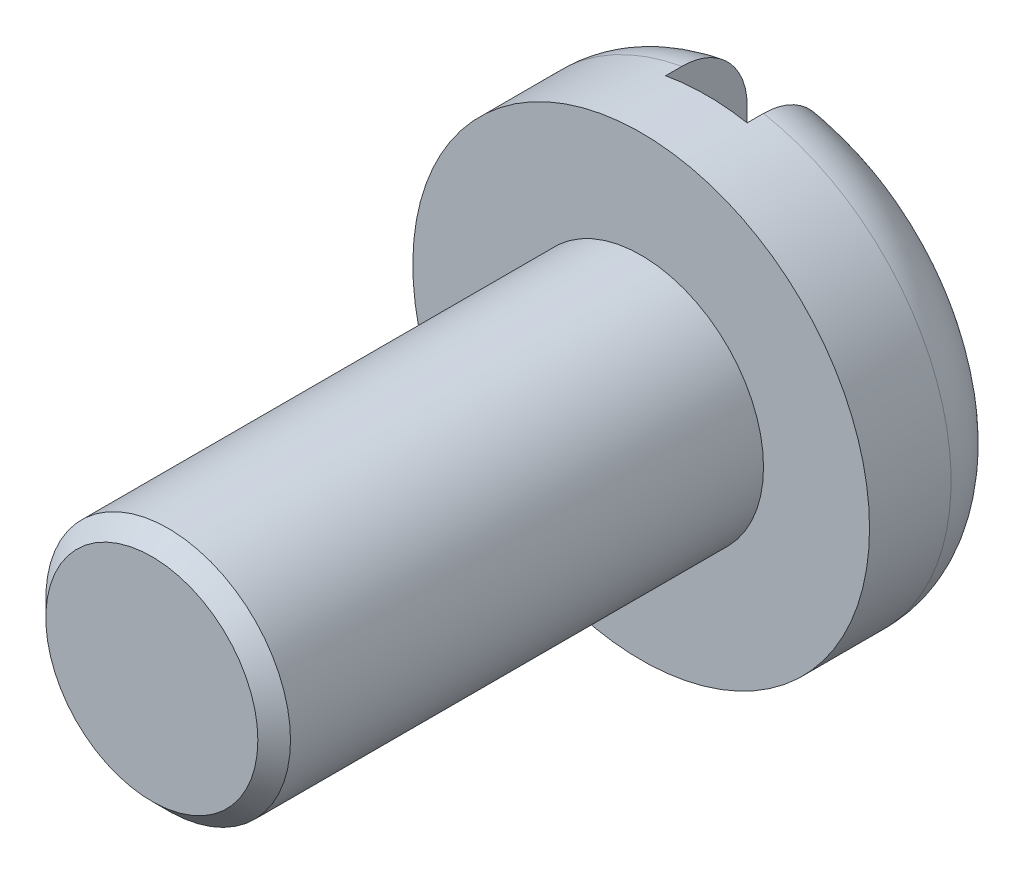
ISO-10303-21;
HEADER;
FILE_DESCRIPTION(('STEP AP214'),'2;1');
FILE_NAME('part.step','',(''),(''),'','','');
FILE_SCHEMA(('AUTOMOTIVE_DESIGN { 1 0 10303 214 1 1 1 1 }'));
ENDSEC;
DATA;
#1=APPLICATION_CONTEXT('core data for automotive mechanical design processes');
#2=APPLICATION_PROTOCOL_DEFINITION('international standard','automotive_design',2000,#1);
#3=PRODUCT_CONTEXT('',#1,'mechanical');
#4=PRODUCT('Part','Part','',(#3));
#5=PRODUCT_RELATED_PRODUCT_CATEGORY('part','',(#4));
#6=PRODUCT_DEFINITION_FORMATION('','',#4);
#7=PRODUCT_DEFINITION_CONTEXT('part definition',#1,'design');
#8=PRODUCT_DEFINITION('design','',#6,#7);
#9=PRODUCT_DEFINITION_SHAPE('','',#8);
#10=(LENGTH_UNIT() NAMED_UNIT(*) SI_UNIT(.MILLI.,.METRE.));
#11=(NAMED_UNIT(*) PLANE_ANGLE_UNIT() SI_UNIT($,.RADIAN.));
#12=(NAMED_UNIT(*) SI_UNIT($,.STERADIAN.) SOLID_ANGLE_UNIT());
#13=UNCERTAINTY_MEASURE_WITH_UNIT(LENGTH_MEASURE(1.E-05),#10,'distance_accuracy_value','');
#14=(GEOMETRIC_REPRESENTATION_CONTEXT(3) GLOBAL_UNCERTAINTY_ASSIGNED_CONTEXT((#13)) GLOBAL_UNIT_ASSIGNED_CONTEXT((#10,
#11,#12)) REPRESENTATION_CONTEXT('',''));
#15=CARTESIAN_POINT('',(0.,0.,0.));
#16=DIRECTION('',(0.,0.,1.));
#17=DIRECTION('',(1.,0.,0.));
#18=AXIS2_PLACEMENT_3D('',#15,#16,#17);
#19=CARTESIAN_POINT('',(0.,0.,0.));
#20=DIRECTION('',(0.,0.,1.));
#21=DIRECTION('',(1.,0.,0.));
#22=AXIS2_PLACEMENT_3D('',#19,#20,#21);
#23=PLANE('',#22);
#24=CARTESIAN_POINT('',(0.,0.,0.));
#25=DIRECTION('',(0.,0.,1.));
#26=DIRECTION('',(1.,0.,0.));
#27=AXIS2_PLACEMENT_3D('',#24,#25,#26);
#28=CIRCLE('',#27,2.);
#29=CARTESIAN_POINT('',(-0.5,-1.93649167310372,0.));
#30=VERTEX_POINT('',#29);
#31=CARTESIAN_POINT('',(-0.5,1.93649167310367,0.));
#32=VERTEX_POINT('',#31);
#33=EDGE_CURVE('E106',#30,#32,#28,.F.);
#34=ORIENTED_EDGE('',*,*,#33,.T.);
#35=DIRECTION('',(0.,1.,0.));
#36=VECTOR('',#35,1.);
#37=CARTESIAN_POINT('',(-0.499999999999987,-2.79999999999997,0.));
#38=LINE('',#37,#36);
#39=EDGE_CURVE('E94',#30,#32,#38,.T.);
#40=ORIENTED_EDGE('',*,*,#39,.F.);
#41=EDGE_LOOP('',(#34,#40));
#42=FACE_BOUND('',#41,.T.);
#43=ADVANCED_FACE('F32',(#42),#23,.F.);
#44=CARTESIAN_POINT('',(0.,0.,0.8));
#45=DIRECTION('',(0.,0.,1.));
#46=DIRECTION('',(1.,0.,0.));
#47=AXIS2_PLACEMENT_3D('',#44,#45,#46);
#48=TOROIDAL_SURFACE('',#47,2.,0.8);
#49=CARTESIAN_POINT('',(-0.500000000000042,-2.574922324518,0.298155199525206));
#50=CARTESIAN_POINT('',(-0.500000000000064,-2.54598098806483,0.262888244626921));
#51=CARTESIAN_POINT('',(-0.500000000000017,-2.51399085375587,0.230073383773666));
#52=CARTESIAN_POINT('',(-0.499999999999956,-2.44489770330804,0.170290375937446));
#53=CARTESIAN_POINT('',(-0.499999999999943,-2.40778734484533,0.14333077083532));
#54=CARTESIAN_POINT('',(-0.499999999999947,-2.3296378729819,0.0960285229568036));
#55=CARTESIAN_POINT('',(-0.499999999999966,-2.28860446041037,0.0756764619958677));
#56=CARTESIAN_POINT('',(-0.500000000000008,-2.20376135068432,0.0420244924251314));
#57=CARTESIAN_POINT('',(-0.500000000000031,-2.15995236699676,0.0287227796749258));
#58=CARTESIAN_POINT('',(-0.500000000000025,-2.06997091394333,0.00925183248130342));
#59=CARTESIAN_POINT('',(-0.499999999999993,-2.02377040690542,0.00321234810147741));
#60=CARTESIAN_POINT('',(-0.49999999999998,-1.93100263497437,-0.00124877563349874));
#61=CARTESIAN_POINT('',(-0.499999999999998,-1.88443530458141,0.000330977762108387));
#62=CARTESIAN_POINT('',(-0.500000000000003,-1.79088327346646,0.0111178799923772));
#63=CARTESIAN_POINT('',(-0.49999999999999,-1.7439228144173,0.0205353470541913));
#64=CARTESIAN_POINT('',(-0.499999999999983,-1.65217679369091,0.046935421935074));
#65=CARTESIAN_POINT('',(-0.499999999999988,-1.60739158710236,0.0639192603179388));
#66=CARTESIAN_POINT('',(-0.499999999999985,-1.52019073232421,0.105445949791884));
#67=CARTESIAN_POINT('',(-0.499999999999978,-1.47785400136175,0.130154782287374));
#68=CARTESIAN_POINT('',(-0.499999999999995,-1.39792453015221,0.18634538845088));
#69=CARTESIAN_POINT('',(-0.50000000000002,-1.36033263198163,0.217828361667366));
#70=CARTESIAN_POINT('',(-0.500000000000009,-1.29120447950117,0.286694192458513));
#71=CARTESIAN_POINT('',(-0.499999999999974,-1.25965123178523,0.324059937841605));
#72=CARTESIAN_POINT('',(-0.499999999999999,-1.20369168856285,0.403817480274002));
#73=CARTESIAN_POINT('',(-0.500000000000059,-1.17928268604714,0.44620736506247));
#74=CARTESIAN_POINT('',(-0.500000000000053,-1.13992248130589,0.532354713105318));
#75=CARTESIAN_POINT('',(-0.499999999999993,-1.12452210271751,0.575906194985524));
#76=CARTESIAN_POINT('',(-0.49999999999998,-1.10201829416784,0.66509381867765));
#77=CARTESIAN_POINT('',(-0.500000000000027,-1.09490840158941,0.710728307862662));
#78=CARTESIAN_POINT('',(-0.500000000000029,-1.08965339575104,0.798660775802905));
#79=CARTESIAN_POINT('',(-0.499999999999991,-1.09080730068015,0.840918076012923));
#80=CARTESIAN_POINT('',(-0.499999999999982,-1.10037450172082,0.924598224718412));
#81=CARTESIAN_POINT('',(-0.500000000000013,-1.10878745994187,0.966021111961848));
#82=CARTESIAN_POINT('',(-0.500000000000016,-1.13216837267961,1.04597158865165));
#83=CARTESIAN_POINT('',(-0.499999999999991,-1.14698904456269,1.08454267031556));
#84=CARTESIAN_POINT('',(-0.499999999999982,-1.18251177579709,1.15886756045566));
#85=CARTESIAN_POINT('',(-0.5,-1.20321527714693,1.19462067544403));
#86=CARTESIAN_POINT('',(-0.500000000000001,-1.25126751354911,1.26474992143909));
#87=CARTESIAN_POINT('',(-0.499999999999984,-1.27895554890733,1.29889325268955));
#88=CARTESIAN_POINT('',(-0.499999999999989,-1.3392878702617,1.36247528595323));
#89=CARTESIAN_POINT('',(-0.500000000000013,-1.37193384773364,1.39191237529941));
#90=CARTESIAN_POINT('',(-0.500000000000016,-1.44401810740901,1.44758530807222));
#91=CARTESIAN_POINT('',(-0.49999999999999,-1.48378730323865,1.47339358366004));
#92=CARTESIAN_POINT('',(-0.499999999999983,-1.56697728558621,1.51824355540426));
#93=CARTESIAN_POINT('',(-0.5,-1.61039886330884,1.53728378072535));
#94=CARTESIAN_POINT('',(-0.500000000000001,-1.70136104276629,1.56863849264839));
#95=CARTESIAN_POINT('',(-0.499999999999984,-1.74899346897788,1.58068768090996));
#96=CARTESIAN_POINT('',(-0.499999999999989,-1.84561382312309,1.59655662210236));
#97=CARTESIAN_POINT('',(-0.500000000000011,-1.89460174641329,1.60037640322053));
#98=CARTESIAN_POINT('',(-0.500000000000017,-1.9921524314953,1.59956806537918));
#99=CARTESIAN_POINT('',(-0.500000000000002,-2.04071566638595,1.59500198496043));
#100=CARTESIAN_POINT('',(-0.499999999999971,-2.13632725414342,1.57755309739998));
#101=CARTESIAN_POINT('',(-0.499999999999956,-2.18337580544831,1.56467138437918));
#102=CARTESIAN_POINT('',(-0.499999999999962,-2.27328529537051,1.53131446404627));
#103=CARTESIAN_POINT('',(-0.499999999999981,-2.3162240941652,1.51104918059278));
#104=CARTESIAN_POINT('',(-0.499999999999992,-2.39795495079203,1.46340202209778));
#105=CARTESIAN_POINT('',(-0.499999999999983,-2.43674763214091,1.43602121925978));
#106=CARTESIAN_POINT('',(-0.499999999999963,-2.50796623414367,1.37573601278644));
#107=CARTESIAN_POINT('',(-0.499999999999952,-2.54053689486565,1.34300254475207));
#108=CARTESIAN_POINT('',(-0.500000000000021,-2.59957752568887,1.2724306558834));
#109=CARTESIAN_POINT('',(-0.500000000000102,-2.62604823039698,1.23459285062639));
#110=CARTESIAN_POINT('',(-0.500000000000093,-2.67157353959601,1.15573976382321));
#111=CARTESIAN_POINT('',(-0.500000000000008,-2.69077061117966,1.11480669165031));
#112=CARTESIAN_POINT('',(-0.499999999999965,-2.72191897598462,1.03027270766606));
#113=CARTESIAN_POINT('',(-0.500000000000008,-2.73387115561365,0.986672122942012));
#114=CARTESIAN_POINT('',(-0.500000000000021,-2.75005556797333,0.898637160107996));
#115=CARTESIAN_POINT('',(-0.499999999999992,-2.75438419022644,0.854220475286738));
#116=CARTESIAN_POINT('',(-0.499999999999981,-2.75548594113135,0.765281171564029));
#117=CARTESIAN_POINT('',(-0.5,-2.75225733036693,0.720758530631277));
#118=CARTESIAN_POINT('',(-0.500000000000001,-2.73837145135229,0.633077517478008));
#119=CARTESIAN_POINT('',(-0.499999999999984,-2.72774415965583,0.589914372145898));
#120=CARTESIAN_POINT('',(-0.499999999999989,-2.69941974932609,0.506017569457456));
#121=CARTESIAN_POINT('',(-0.500000000000011,-2.68173177147183,0.465280848903881));
#122=CARTESIAN_POINT('',(-0.499999999999995,-2.6486018933594,0.403636926764014));
#123=CARTESIAN_POINT('',(-0.499999999999978,-2.63530419806188,0.381550226470756));
#124=CARTESIAN_POINT('',(-0.499999999999995,-2.60663582244822,0.338766791147228));
#125=CARTESIAN_POINT('',(-0.50000000000003,-2.59126516322905,0.318070041974346));
#126=CARTESIAN_POINT('',(-0.500000000000042,-2.574922324518,0.298155199525206));
#127=B_SPLINE_CURVE_WITH_KNOTS('',3,(#49,#50,#51,#52,#53,#54,#55,#56,#57,#58,#59,#60,#61,#62,
#63,#64,#65,#66,#67,#68,#69,#70,#71,#72,#73,#74,#75,#76,#77,#78,#79,#80,#81,#82,#83,#84,#85,#86,
#87,#88,#89,#90,#91,#92,#93,#94,#95,#96,#97,#98,#99,#100,#101,#102,#103,#104,#105,#106,#107,
#108,#109,#110,#111,#112,#113,#114,#115,#116,#117,#118,#119,#120,#121,#122,#123,#124,#125,#126),
.UNSPECIFIED.,.T.,.F.,(4,2,2,2,2,2,2,2,2,2,2,2,2,2,2,2,2,2,2,2,2,2,2,2,2,2,2,2,2,2,2,2,2,2,2,2,
2,2,4),(0.,0.136769193085177,0.273736589920394,0.410507891781044,0.547244177795591,
0.68638878734272,0.825558832649965,0.968588530443755,1.11164149850147,1.25800809201401,
1.40440062513062,1.5503749329885,1.69629385824464,1.83412607973232,1.97185078597633,
2.0980401485379,2.22422363762208,2.34764929877682,2.47110524015382,2.60242555016918,
2.73379076312852,2.87538180880564,3.01700360631827,3.16369746316592,3.3103908175575,
3.45600330421428,3.60159663596026,3.74333790058163,3.88505781926302,4.02291414270548,
4.16075385566943,4.29573382427652,4.43069727483905,4.56394170366886,4.69721680381809,
4.82995504436945,4.96252199615689,5.0397547671254,5.11698675213922),.UNSPECIFIED.);
#128=CARTESIAN_POINT('',(-0.499999999999917,-2.75499546279123,0.8));
#129=VERTEX_POINT('',#128);
#130=EDGE_CURVE('E147',#129,#30,#127,.T.);
#131=ORIENTED_EDGE('',*,*,#130,.F.);
#132=CARTESIAN_POINT('',(0.,0.,0.8));
#133=DIRECTION('',(0.,0.,1.));
#134=DIRECTION('',(1.,0.,0.));
#135=AXIS2_PLACEMENT_3D('',#132,#133,#134);
#136=CIRCLE('',#135,2.8);
#137=CARTESIAN_POINT('',(-0.500000000000028,2.7549954627912,0.8));
#138=VERTEX_POINT('',#137);
#139=EDGE_CURVE('E107',#138,#129,#136,.T.);
#140=ORIENTED_EDGE('',*,*,#139,.F.);
#141=CARTESIAN_POINT('',(-0.499999999356501,1.17166829458473,0.46418686904753));
#142=CARTESIAN_POINT('',(-0.499999999007219,1.19267357615146,0.422417780507498));
#143=CARTESIAN_POINT('',(-0.499999999733716,1.21743797333864,0.382484068214903));
#144=CARTESIAN_POINT('',(-0.500000000266866,1.27341877739793,0.30735400104595));
#145=CARTESIAN_POINT('',(-0.500000000071411,1.30464980628043,0.272168686107269));
#146=CARTESIAN_POINT('',(-0.499999999928815,1.37235748491803,0.207510707786025));
#147=CARTESIAN_POINT('',(-0.499999999980891,1.40881724534706,0.178020342456158));
#148=CARTESIAN_POINT('',(-0.500000000019074,1.48597833534383,0.125299278185819));
#149=CARTESIAN_POINT('',(-0.500000000005209,1.5266777935571,0.10206583361082));
#150=CARTESIAN_POINT('',(-0.499999999994576,1.61302287504707,0.0615752064472882));
#151=CARTESIAN_POINT('',(-0.49999999999854,1.65880348194959,0.0446051102007901));
#152=CARTESIAN_POINT('',(-0.500000000001434,1.75256520926182,0.0185470420039302));
#153=CARTESIAN_POINT('',(-0.500000000000363,1.80054669322732,0.00946037726494076));
#154=CARTESIAN_POINT('',(-0.499999999999581,1.89757398197848,-0.000503602469736283));
#155=CARTESIAN_POINT('',(-0.499999999999874,1.94662352533386,-0.00134482041100667));
#156=CARTESIAN_POINT('',(-0.500000000000099,2.04413927232538,0.00542159003976711));
#157=CARTESIAN_POINT('',(-0.50000000000003,2.09260554052552,0.0130282744560471));
#158=CARTESIAN_POINT('',(-0.499999999999972,2.18638284766427,0.0363136597219342));
#159=CARTESIAN_POINT('',(-0.499999999999981,2.23174072313643,0.0518035405617408));
#160=CARTESIAN_POINT('',(-0.499999999999993,2.31909462384134,0.090397317595015));
#161=CARTESIAN_POINT('',(-0.499999999999995,2.36109117492435,0.113500019923071));
#162=CARTESIAN_POINT('',(-0.500000000000005,2.43926883717495,0.165951907511055));
#163=CARTESIAN_POINT('',(-0.500000000000012,2.47558066725009,0.195106304948042));
#164=CARTESIAN_POINT('',(-0.499999999999961,2.54264688321358,0.259229250250845));
#165=CARTESIAN_POINT('',(-0.499999999999904,2.57340200694014,0.294197025011071));
#166=CARTESIAN_POINT('',(-0.499999999999903,2.62773971054273,0.368070214995808));
#167=CARTESIAN_POINT('',(-0.499999999999957,2.65147213285657,0.406865462624137));
#168=CARTESIAN_POINT('',(-0.500000000000016,2.69196936040413,0.487936656036954));
#169=CARTESIAN_POINT('',(-0.500000000000021,2.70873482403591,0.530212272463766));
#170=CARTESIAN_POINT('',(-0.500000000000007,2.73457417408301,0.616346516557325));
#171=CARTESIAN_POINT('',(-0.499999999999988,2.74376162387099,0.660171105210678));
#172=CARTESIAN_POINT('',(-0.499999999999985,2.75459021275317,0.748742353799453));
#173=CARTESIAN_POINT('',(-0.5,2.7562317357709,0.793488966707539));
#174=CARTESIAN_POINT('',(-0.500000000000001,2.75193406507526,0.882296051446308));
#175=CARTESIAN_POINT('',(-0.499999999999988,2.7460486796649,0.926359139654561));
#176=CARTESIAN_POINT('',(-0.499999999999985,2.72696875366774,1.01287203680982));
#177=CARTESIAN_POINT('',(-0.499999999999996,2.7137742978086,1.05532186445184));
#178=CARTESIAN_POINT('',(-0.500000000000004,2.68046062721738,1.13744918694941));
#179=CARTESIAN_POINT('',(-0.500000000000001,2.66033585198125,1.17712442478083));
#180=CARTESIAN_POINT('',(-0.499999999999972,2.61376491387087,1.25257058669212));
#181=CARTESIAN_POINT('',(-0.499999999999946,2.58731858541521,1.28834140846729));
#182=CARTESIAN_POINT('',(-0.499999999999944,2.5286285872319,1.35530700199108));
#183=CARTESIAN_POINT('',(-0.49999999999997,2.49633699794396,1.38645975622345));
#184=CARTESIAN_POINT('',(-0.500000000000003,2.42705565551312,1.44300481630574));
#185=CARTESIAN_POINT('',(-0.500000000000012,2.39006560545065,1.4683967578179));
#186=CARTESIAN_POINT('',(-0.499999999999989,2.31180075625716,1.51316085536133));
#187=CARTESIAN_POINT('',(-0.499999999999956,2.27046570719732,1.53242761609144));
#188=CARTESIAN_POINT('',(-0.500000000000017,2.18519964476282,1.5639258999662));
#189=CARTESIAN_POINT('',(-0.50000000000011,2.14126836546617,1.57615670106222));
#190=CARTESIAN_POINT('',(-0.500000000000113,2.0509556255416,1.59355624479341));
#191=CARTESIAN_POINT('',(-0.500000000000017,2.00454082128188,1.59855176700942));
#192=CARTESIAN_POINT('',(-0.499999999999956,1.91151980618021,1.60090411836747));
#193=CARTESIAN_POINT('',(-0.49999999999999,1.86491356935927,1.598259874062));
#194=CARTESIAN_POINT('',(-0.500000000000012,1.77145545960404,1.58532047051574));
#195=CARTESIAN_POINT('',(-0.499999999999998,1.72463270294184,1.57481489696403));
#196=CARTESIAN_POINT('',(-0.499999999999975,1.63334046852717,1.54626900741675));
#197=CARTESIAN_POINT('',(-0.499999999999965,1.58887138887822,1.52822742133131));
#198=CARTESIAN_POINT('',(-0.499999999999981,1.50252916218816,1.48463309532452));
#199=CARTESIAN_POINT('',(-0.500000000000006,1.46073564384593,1.45892237778647));
#200=CARTESIAN_POINT('',(-0.499999999999967,1.38206930059477,1.40081364332638));
#201=CARTESIAN_POINT('',(-0.499999999999901,1.34519732545493,1.36841447400829));
#202=CARTESIAN_POINT('',(-0.499999999999988,1.27778696417982,1.29792975959294));
#203=CARTESIAN_POINT('',(-0.500000000000139,1.24721327878641,1.25987808510847));
#204=CARTESIAN_POINT('',(-0.499999999999834,1.19335612750725,1.17891848718443));
#205=CARTESIAN_POINT('',(-0.499999999999378,1.17006907448704,1.13601296745241));
#206=CARTESIAN_POINT('',(-0.500000000000586,1.13308127721679,1.04923883676593));
#207=CARTESIAN_POINT('',(-0.500000000002125,1.11889370908597,1.00557843081165));
#208=CARTESIAN_POINT('',(-0.499999999997849,1.09880075562412,0.916385157633365));
#209=CARTESIAN_POINT('',(-0.499999999992037,1.09289167625854,0.870853134905996));
#210=CARTESIAN_POINT('',(-0.500000000007284,1.08985288930712,0.783258016819354));
#211=CARTESIAN_POINT('',(-0.500000000026179,1.09204273372152,0.741216766124547));
#212=CARTESIAN_POINT('',(-0.49999999997383,1.10358165617668,0.658171003192909));
#213=CARTESIAN_POINT('',(-0.49999999990271,1.11292095412185,0.617165153669265));
#214=CARTESIAN_POINT('',(-0.500000000047387,1.13173716442364,0.557832094241281));
#215=CARTESIAN_POINT('',(-0.500000000134682,1.13868424430638,0.538665049516267));
#216=CARTESIAN_POINT('',(-0.499999999865315,1.15407246676007,0.500944817183134));
#217=CARTESIAN_POINT('',(-0.499999999508732,1.16251334591183,0.482391522028879));
#218=CARTESIAN_POINT('',(-0.499999999356501,1.17166829458473,0.46418686904753));
#219=B_SPLINE_CURVE_WITH_KNOTS('',3,(#141,#142,#143,#144,#145,#146,#147,#148,#149,#150,#151,
#152,#153,#154,#155,#156,#157,#158,#159,#160,#161,#162,#163,#164,#165,#166,#167,#168,#169,#170,
#171,#172,#173,#174,#175,#176,#177,#178,#179,#180,#181,#182,#183,#184,#185,#186,#187,#188,#189,
#190,#191,#192,#193,#194,#195,#196,#197,#198,#199,#200,#201,#202,#203,#204,#205,#206,#207,#208,
#209,#210,#211,#212,#213,#214,#215,#216,#217,#218),.UNSPECIFIED.,.T.,.F.,(4,2,2,2,2,2,2,2,2,2,2,
2,2,2,2,2,2,2,2,2,2,2,2,2,2,2,2,2,2,2,2,2,2,2,2,2,2,2,4),(0.,0.140179962938361,
0.280680424374975,0.420736870704918,0.560731757564349,0.706519737259577,0.852331886544,
0.998782091076204,1.14521593278487,1.28829675581313,1.43135515114943,1.57037428224833,
1.70937494032989,1.84515095108353,1.98091412768567,2.11460378002058,2.24828663038504,
2.38101913030596,2.5137500916072,2.64658779796054,2.77942898413334,2.91341306192966,
3.04740561107584,3.18359253664264,3.31979343557669,3.45920410723755,3.59863436815094,
3.74193637650256,3.88526254616111,4.03177315461668,4.17830902741986,4.32399983406551,
4.46961880536737,4.60659735480203,4.74351476205878,4.86920017065931,4.99471395445012,
5.05582079954678,5.11691687967277),.UNSPECIFIED.);
#220=EDGE_CURVE('E103',#32,#138,#219,.T.);
#221=ORIENTED_EDGE('',*,*,#220,.F.);
#222=ORIENTED_EDGE('',*,*,#33,.F.);
#223=EDGE_LOOP('',(#131,#140,#221,#222));
#224=FACE_BOUND('',#223,.T.);
#225=ADVANCED_FACE('F163',(#224),#48,.T.);
#226=CARTESIAN_POINT('',(0.,0.,1.8));
#227=DIRECTION('',(0.,0.,1.));
#228=DIRECTION('',(1.,0.,0.));
#229=AXIS2_PLACEMENT_3D('',#226,#227,#228);
#230=PLANE('',#229);
#231=CARTESIAN_POINT('',(0.,0.,1.8));
#232=DIRECTION('',(0.,0.,1.));
#233=DIRECTION('',(1.,0.,0.));
#234=AXIS2_PLACEMENT_3D('',#231,#232,#233);
#235=CIRCLE('',#234,2.8);
#236=CARTESIAN_POINT('',(2.8,0.,1.8));
#237=VERTEX_POINT('',#236);
#238=EDGE_CURVE('E175',#237,#237,#235,.T.);
#239=ORIENTED_EDGE('',*,*,#238,.T.);
#240=EDGE_LOOP('',(#239));
#241=FACE_BOUND('',#240,.T.);
#242=CARTESIAN_POINT('',(0.,0.,1.8));
#243=DIRECTION('',(0.,0.,1.));
#244=DIRECTION('',(1.,0.,0.));
#245=AXIS2_PLACEMENT_3D('',#242,#243,#244);
#246=CIRCLE('',#245,1.5);
#247=CARTESIAN_POINT('',(1.5,0.,1.8));
#248=VERTEX_POINT('',#247);
#249=EDGE_CURVE('E173',#248,#248,#246,.T.);
#250=ORIENTED_EDGE('',*,*,#249,.F.);
#251=EDGE_LOOP('',(#250));
#252=FACE_BOUND('',#251,.T.);
#253=ADVANCED_FACE('F180',(#241,#252),#230,.T.);
#254=CARTESIAN_POINT('',(0.,0.,1.8));
#255=DIRECTION('',(0.,0.,-1.));
#256=DIRECTION('',(-1.,0.,0.));
#257=AXIS2_PLACEMENT_3D('',#254,#255,#256);
#258=CYLINDRICAL_SURFACE('',#257,2.8);
#259=CARTESIAN_POINT('',(0.499999999999987,-2.75499546279118,0.8));
#260=VERTEX_POINT('',#259);
#261=CARTESIAN_POINT('',(0.5,2.75499546279118,0.8));
#262=VERTEX_POINT('',#261);
#263=EDGE_CURVE('E102',#260,#262,#136,.T.);
#264=ORIENTED_EDGE('',*,*,#263,.T.);
#265=DIRECTION('',(0.,0.,-1.));
#266=VECTOR('',#265,1.);
#267=CARTESIAN_POINT('',(0.5,2.75499546279118,1.8));
#268=LINE('',#267,#266);
#269=CARTESIAN_POINT('',(0.5,2.75499546279118,1.));
#270=VERTEX_POINT('',#269);
#271=EDGE_CURVE('E47',#262,#270,#268,.F.);
#272=ORIENTED_EDGE('',*,*,#271,.T.);
#273=CARTESIAN_POINT('',(0.,0.,1.));
#274=DIRECTION('',(0.,0.,1.));
#275=DIRECTION('',(1.,0.,0.));
#276=AXIS2_PLACEMENT_3D('',#273,#274,#275);
#277=CIRCLE('',#276,2.8);
#278=CARTESIAN_POINT('',(-0.500000000000028,2.7549954627912,1.));
#279=VERTEX_POINT('',#278);
#280=EDGE_CURVE('E36',#270,#279,#277,.T.);
#281=ORIENTED_EDGE('',*,*,#280,.T.);
#282=DIRECTION('',(0.,0.,-1.));
#283=VECTOR('',#282,1.);
#284=CARTESIAN_POINT('',(-0.500000000000028,2.7549954627912,1.8));
#285=LINE('',#284,#283);
#286=EDGE_CURVE('E154',#279,#138,#285,.T.);
#287=ORIENTED_EDGE('',*,*,#286,.T.);
#288=ORIENTED_EDGE('',*,*,#139,.T.);
#289=DIRECTION('',(0.,0.,-1.));
#290=VECTOR('',#289,1.);
#291=CARTESIAN_POINT('',(-0.499999999999917,-2.75499546279123,1.8));
#292=LINE('',#291,#290);
#293=CARTESIAN_POINT('',(-0.499999999999917,-2.75499546279123,1.));
#294=VERTEX_POINT('',#293);
#295=EDGE_CURVE('E55',#129,#294,#292,.F.);
#296=ORIENTED_EDGE('',*,*,#295,.T.);
#297=CARTESIAN_POINT('',(0.499999999999987,-2.75499546279118,1.));
#298=VERTEX_POINT('',#297);
#299=EDGE_CURVE('E11',#294,#298,#277,.T.);
#300=ORIENTED_EDGE('',*,*,#299,.T.);
#301=DIRECTION('',(0.,0.,-1.));
#302=VECTOR('',#301,1.);
#303=CARTESIAN_POINT('',(0.499999999999987,-2.75499546279118,1.8));
#304=LINE('',#303,#302);
#305=EDGE_CURVE('E161',#298,#260,#304,.T.);
#306=ORIENTED_EDGE('',*,*,#305,.T.);
#307=EDGE_LOOP('',(#264,#272,#281,#287,#288,#296,#300,#306));
#308=FACE_BOUND('',#307,.T.);
#309=ORIENTED_EDGE('',*,*,#238,.F.);
#310=EDGE_LOOP('',(#309));
#311=FACE_BOUND('',#310,.T.);
#312=ADVANCED_FACE('F34',(#308,#311),#258,.T.);
#313=CARTESIAN_POINT('',(0.5,1.93649167311966,0.));
#314=VERTEX_POINT('',#313);
#315=CARTESIAN_POINT('',(0.5,-1.93649167310367,0.));
#316=VERTEX_POINT('',#315);
#317=EDGE_CURVE('E100',#314,#316,#28,.F.);
#318=ORIENTED_EDGE('',*,*,#317,.T.);
#319=DIRECTION('',(0.,1.,0.));
#320=VECTOR('',#319,1.);
#321=CARTESIAN_POINT('',(0.499999999999945,-2.79999999999997,0.));
#322=LINE('',#321,#320);
#323=EDGE_CURVE('E85',#316,#314,#322,.T.);
#324=ORIENTED_EDGE('',*,*,#323,.T.);
#325=EDGE_LOOP('',(#318,#324));
#326=FACE_BOUND('',#325,.T.);
#327=ADVANCED_FACE('F105',(#326),#23,.F.);
#328=CARTESIAN_POINT('',(0.500000000879811,-2.5749223251037,0.298155199044635));
#329=CARTESIAN_POINT('',(0.500000001072099,-2.60316672277935,0.332579391269987));
#330=CARTESIAN_POINT('',(0.500000000287356,-2.62854948203002,0.369390453220737));
#331=CARTESIAN_POINT('',(0.49999999971223,-2.67280796870897,0.446774396094247));
#332=CARTESIAN_POINT('',(0.499999999922898,-2.6916767992218,0.487351206867537));
#333=CARTESIAN_POINT('',(0.50000000007707,-2.7223109911068,0.571105483193361));
#334=CARTESIAN_POINT('',(0.500000000020594,-2.73407684575013,0.614282767925082));
#335=CARTESIAN_POINT('',(0.499999999979301,-2.75014124796438,0.701994783671056));
#336=CARTESIAN_POINT('',(0.499999999994469,-2.75444151138484,0.746529200374766));
#337=CARTESIAN_POINT('',(0.500000000005473,-2.75544604981184,0.83542907904915));
#338=CARTESIAN_POINT('',(0.500000000001418,-2.75219346258918,0.879794058020162));
#339=CARTESIAN_POINT('',(0.499999999998472,-2.73828036853049,0.967346901444565));
#340=CARTESIAN_POINT('',(0.49999999999958,-2.72761975658292,1.01053474918676));
#341=CARTESIAN_POINT('',(0.500000000000365,-2.69922170832223,1.09448759036863));
#342=CARTESIAN_POINT('',(0.500000000000043,-2.68148840045398,1.13525398132962));
#343=CARTESIAN_POINT('',(0.499999999999847,-2.63947637337052,1.21325938895333));
#344=CARTESIAN_POINT('',(0.499999999999973,-2.61519753470354,1.25049834122576));
#345=CARTESIAN_POINT('',(0.500000000000029,-2.56061340850498,1.32069364818094));
#346=CARTESIAN_POINT('',(0.499999999999957,-2.53026581413391,1.35361708906897));
#347=CARTESIAN_POINT('',(0.499999999999933,-2.46454688604084,1.41399178546976));
#348=CARTESIAN_POINT('',(0.499999999999979,-2.42917527522167,1.44144273894931));
#349=CARTESIAN_POINT('',(0.499999999999994,-2.35385643502779,1.49055090188861));
#350=CARTESIAN_POINT('',(0.499999999999961,-2.31384845997951,1.51211489687122));
#351=CARTESIAN_POINT('',(0.499999999999929,-2.23083915065947,1.5483853151228));
#352=CARTESIAN_POINT('',(0.499999999999931,-2.18783752986508,1.56309108094895));
#353=CARTESIAN_POINT('',(0.499999999999931,-2.09903776473294,1.58559376537929));
#354=CARTESIAN_POINT('',(0.49999999999993,-2.05319854673997,1.59322847724039));
#355=CARTESIAN_POINT('',(0.49999999999996,-1.96089071229865,1.60091468708442));
#356=CARTESIAN_POINT('',(0.499999999999991,-1.91442201135201,1.60096515670798));
#357=CARTESIAN_POINT('',(0.499999999999982,-1.82081512442864,1.5934796467817));
#358=CARTESIAN_POINT('',(0.49999999999994,-1.77369359984158,1.58573528250449));
#359=CARTESIAN_POINT('',(0.49999999999995,-1.68135124221952,1.56264149053293));
#360=CARTESIAN_POINT('',(0.500000000000002,-1.63613071586754,1.54729084080561));
#361=CARTESIAN_POINT('',(0.499999999999999,-1.54772088198927,1.5089710882286));
#362=CARTESIAN_POINT('',(0.499999999999941,-1.50460810218891,1.48582516379542));
#363=CARTESIAN_POINT('',(0.499999999999949,-1.42285362314232,1.43263708398556));
#364=CARTESIAN_POINT('',(0.500000000000017,-1.3842127749951,1.40259361910328));
#365=CARTESIAN_POINT('',(0.500000000000012,-1.31255959666647,1.33630715335168));
#366=CARTESIAN_POINT('',(0.499999999999941,-1.27955494140269,1.3000558314644));
#367=CARTESIAN_POINT('',(0.499999999999949,-1.22046453800474,1.22228169989798));
#368=CARTESIAN_POINT('',(0.50000000000003,-1.19437681399472,1.18076040065168));
#369=CARTESIAN_POINT('',(0.500000000000027,-1.15142216098089,1.09574586213182));
#370=CARTESIAN_POINT('',(0.499999999999951,-1.13416335222775,1.05245139645305));
#371=CARTESIAN_POINT('',(0.499999999999939,-1.10793289425679,0.963428982378384));
#372=CARTESIAN_POINT('',(0.500000000000003,-1.09895451442801,0.917703042402015));
#373=CARTESIAN_POINT('',(0.499999999999998,-1.09022472356232,0.829298122134937));
#374=CARTESIAN_POINT('',(0.499999999999941,-1.08975649686917,0.786688925401454));
#375=CARTESIAN_POINT('',(0.499999999999949,-1.09624620786004,0.702044692272699));
#376=CARTESIAN_POINT('',(0.500000000000015,-1.10320328532025,0.660009589939735));
#377=CARTESIAN_POINT('',(0.500000000000013,-1.12382367656128,0.579065755118516));
#378=CARTESIAN_POINT('',(0.49999999999995,-1.13726593553652,0.540100063897481));
#379=CARTESIAN_POINT('',(0.49999999999994,-1.17014975791577,0.464794622695565));
#380=CARTESIAN_POINT('',(0.499999999999994,-1.18959269992823,0.428455478512849));
#381=CARTESIAN_POINT('',(0.500000000000007,-1.23503762747252,0.357176464248562));
#382=CARTESIAN_POINT('',(0.49999999999996,-1.26135130749175,0.322435696992511));
#383=CARTESIAN_POINT('',(0.49999999999993,-1.31903408169354,0.257443494849274));
#384=CARTESIAN_POINT('',(0.499999999999946,-1.35040489701462,0.227193595134763));
#385=CARTESIAN_POINT('',(0.499999999999943,-1.42003468298558,0.169555271876546));
#386=CARTESIAN_POINT('',(0.499999999999921,-1.45864388595744,0.142589172665923));
#387=CARTESIAN_POINT('',(0.499999999999969,-1.53969772981556,0.0952129953060812));
#388=CARTESIAN_POINT('',(0.50000000000004,-1.58214329645024,0.0748045050067149));
#389=CARTESIAN_POINT('',(0.499999999999959,-1.67157713375841,0.040373490367606));
#390=CARTESIAN_POINT('',(0.499999999999799,-1.71868053469734,0.0266488619012781));
#391=CARTESIAN_POINT('',(0.500000000000091,-1.81452842648651,0.00733250693377024));
#392=CARTESIAN_POINT('',(0.500000000000542,-1.86327288106042,0.00174060077521762));
#393=CARTESIAN_POINT('',(0.499999999999378,-1.96081528894648,-0.00104060646324223));
#394=CARTESIAN_POINT('',(0.49999999999777,-2.00961228142522,0.00173720006392133));
#395=CARTESIAN_POINT('',(0.50000000000212,-2.10601253288823,0.0156698370040204));
#396=CARTESIAN_POINT('',(0.500000000008079,-2.15361562973939,0.026825798887446));
#397=CARTESIAN_POINT('',(0.499999999992096,-2.24497498800377,0.0569114625320277));
#398=CARTESIAN_POINT('',(0.499999999970849,-2.28879770253638,0.0756396540687247));
#399=CARTESIAN_POINT('',(0.500000000029,-2.37250420976848,0.1203815830717));
#400=CARTESIAN_POINT('',(0.500000000108257,-2.41239348348014,0.146384983262922));
#401=CARTESIAN_POINT('',(0.499999999933198,-2.47270069368019,0.193717404759919));
#402=CARTESIAN_POINT('',(0.499999999794882,-2.49473023944843,0.213029740806942));
#403=CARTESIAN_POINT('',(0.500000000205004,-2.53655931776771,0.253936127323133));
#404=CARTESIAN_POINT('',(0.500000000753431,-2.55635889021424,0.275530136958482));
#405=CARTESIAN_POINT('',(0.500000000879811,-2.5749223251037,0.298155199044635));
#406=B_SPLINE_CURVE_WITH_KNOTS('',3,(#328,#329,#330,#331,#332,#333,#334,#335,#336,#337,#338,
#339,#340,#341,#342,#343,#344,#345,#346,#347,#348,#349,#350,#351,#352,#353,#354,#355,#356,#357,
#358,#359,#360,#361,#362,#363,#364,#365,#366,#367,#368,#369,#370,#371,#372,#373,#374,#375,#376,
#377,#378,#379,#380,#381,#382,#383,#384,#385,#386,#387,#388,#389,#390,#391,#392,#393,#394,#395,
#396,#397,#398,#399,#400,#401,#402,#403,#404,#405),.UNSPECIFIED.,.T.,.F.,(4,2,2,2,2,2,2,2,2,2,2,
2,2,2,2,2,2,2,2,2,2,2,2,2,2,2,2,2,2,2,2,2,2,2,2,2,2,2,4),(0.,0.13347948049619,0.267099858043289,
0.400710955161736,0.534291339789101,0.66711066398364,0.799931872773255,0.932675664918383,
1.06542187971723,1.19912796050581,1.33284141865341,1.46856324275726,1.60429807473887,
1.74307461888265,1.88186997993984,2.02447707815703,2.16710709519683,2.3132187482915,
2.4593581638157,2.60569502038304,2.75199002952824,2.89105727432612,3.03001138070959,
3.15720142762108,3.28437674112491,3.40749433905576,3.53064024334199,3.66083382660082,
3.79107181367926,3.93172557360624,4.07241336560898,4.2189001432263,4.36538368480181,
4.51129230800911,4.65722063973086,4.7994973609199,4.94157294028144,5.02930297479893,
5.11703143952757),.UNSPECIFIED.);
#407=EDGE_CURVE('E88',#316,#260,#406,.T.);
#408=ORIENTED_EDGE('',*,*,#407,.F.);
#409=ORIENTED_EDGE('',*,*,#317,.F.);
#410=CARTESIAN_POINT('',(0.500000000000014,1.17166829498083,0.464186869246702));
#411=CARTESIAN_POINT('',(0.500000000000019,1.15286490719749,0.501584191541624));
#412=CARTESIAN_POINT('',(0.499999999999944,1.1370473935071,0.540502060888832));
#413=CARTESIAN_POINT('',(0.499999999999947,1.11208351406139,0.620439318934003));
#414=CARTESIAN_POINT('',(0.500000000000025,1.10293831736921,0.661459074558685));
#415=CARTESIAN_POINT('',(0.500000000000032,1.0917839378532,0.744535161547929));
#416=CARTESIAN_POINT('',(0.49999999999996,1.08978638447821,0.786593070199633));
#417=CARTESIAN_POINT('',(0.49999999999993,1.09307364472781,0.870417588011927));
#418=CARTESIAN_POINT('',(0.499999999999971,1.09835784698396,0.912184221331787));
#419=CARTESIAN_POINT('',(0.499999999999975,1.11572332154511,0.993310454340729));
#420=CARTESIAN_POINT('',(0.499999999999939,1.12765363199267,1.03270270101104));
#421=CARTESIAN_POINT('',(0.499999999999951,1.15765003423169,1.10907179049493));
#422=CARTESIAN_POINT('',(0.499999999999999,1.1757176841687,1.14604801708493));
#423=CARTESIAN_POINT('',(0.500000000000002,1.21832528559521,1.21853019136645));
#424=CARTESIAN_POINT('',(0.499999999999953,1.24314000558142,1.25387422278319));
#425=CARTESIAN_POINT('',(0.499999999999937,1.2979289145463,1.32030288074351));
#426=CARTESIAN_POINT('',(0.499999999999969,1.32790478344615,1.35138611448902));
#427=CARTESIAN_POINT('',(0.499999999999976,1.39480977643481,1.41103152886074));
#428=CARTESIAN_POINT('',(0.499999999999946,1.43210639080297,1.43918212139929));
#429=CARTESIAN_POINT('',(0.499999999999944,1.51072119622881,1.48916257776538));
#430=CARTESIAN_POINT('',(0.499999999999974,1.55204044945362,1.51099076609775));
#431=CARTESIAN_POINT('',(0.499999999999972,1.63965054280649,1.54865348724877));
#432=CARTESIAN_POINT('',(0.499999999999938,1.68608379380109,1.56415794792977));
#433=CARTESIAN_POINT('',(0.499999999999953,1.78089689477321,1.58715917306053));
#434=CARTESIAN_POINT('',(0.500000000000002,1.82927682347556,1.5946556133226));
#435=CARTESIAN_POINT('',(0.499999999999999,1.92663314543548,1.60133167735585));
#436=CARTESIAN_POINT('',(0.499999999999947,1.97560976689266,1.60050801265907));
#437=CARTESIAN_POINT('',(0.499999999999943,2.07269237246762,1.59043702295005));
#438=CARTESIAN_POINT('',(0.499999999999992,2.12079845402432,1.58119064670823));
#439=CARTESIAN_POINT('',(0.499999999999981,2.21351928838756,1.55475710949363));
#440=CARTESIAN_POINT('',(0.499999999999924,2.25819038733622,1.53776773873429));
#441=CARTESIAN_POINT('',(0.499999999999966,2.3439226118335,1.49631790865984));
#442=CARTESIAN_POINT('',(0.500000000000065,2.38498429287177,1.47185860157004));
#443=CARTESIAN_POINT('',(0.500000000000074,2.46110962498127,1.4169118938635));
#444=CARTESIAN_POINT('',(0.49999999999999,2.49630913454152,1.38661266808464));
#445=CARTESIAN_POINT('',(0.4999999999999,2.56097498818907,1.32041261157628));
#446=CARTESIAN_POINT('',(0.499999999999894,2.59044208447851,1.2845125169033));
#447=CARTESIAN_POINT('',(0.499999999999912,2.64212035398314,1.20900822189132));
#448=CARTESIAN_POINT('',(0.499999999999935,2.66447970770443,1.16950539482413));
#449=CARTESIAN_POINT('',(0.499999999999955,2.70213653879064,1.08726601386267));
#450=CARTESIAN_POINT('',(0.499999999999952,2.71743464721824,1.0445297493378));
#451=CARTESIAN_POINT('',(0.499999999999938,2.74032399842679,0.957703660346023));
#452=CARTESIAN_POINT('',(0.499999999999928,2.74802348415175,0.913642344282669));
#453=CARTESIAN_POINT('',(0.499999999999962,2.75586392332593,0.824852881675614));
#454=CARTESIAN_POINT('',(0.500000000000005,2.75600523354932,0.780124766707013));
#455=CARTESIAN_POINT('',(0.499999999999996,2.74874876156885,0.691570520094466));
#456=CARTESIAN_POINT('',(0.499999999999944,2.74139859513446,0.647740475610244));
#457=CARTESIAN_POINT('',(0.499999999999946,2.7194547553424,0.561934169189615));
#458=CARTESIAN_POINT('',(0.500000000000001,2.70486113563565,0.519957893525192));
#459=CARTESIAN_POINT('',(0.5,2.66884083825132,0.438969901910687));
#460=CARTESIAN_POINT('',(0.499999999999945,2.64740342565631,0.399962963400045));
#461=CARTESIAN_POINT('',(0.499999999999945,2.59834153851638,0.32605888344201));
#462=CARTESIAN_POINT('',(0.5,2.57071688439261,0.291161861325933));
#463=CARTESIAN_POINT('',(0.5,2.50980390124887,0.226103419096332));
#464=CARTESIAN_POINT('',(0.499999999999944,2.47646490932941,0.195989455978503));
#465=CARTESIAN_POINT('',(0.499999999999946,2.40527784194692,0.14167564483067));
#466=CARTESIAN_POINT('',(0.500000000000004,2.36742945950473,0.117476199777209));
#467=CARTESIAN_POINT('',(0.500000000000025,2.28761534314965,0.0752183940227361));
#468=CARTESIAN_POINT('',(0.499999999999986,2.24559018560578,0.0572723299016524));
#469=CARTESIAN_POINT('',(0.499999999999904,2.15917067825682,0.0285058009642844));
#470=CARTESIAN_POINT('',(0.499999999999861,2.11477606864767,0.0176861192790055));
#471=CARTESIAN_POINT('',(0.499999999999862,2.02373470750858,0.00318864749584922));
#472=CARTESIAN_POINT('',(0.499999999999907,1.97705945352866,-0.000309981669377114));
#473=CARTESIAN_POINT('',(0.499999999999983,1.883766762488,0.000353273239346742));
#474=CARTESIAN_POINT('',(0.500000000000012,1.837149331945,0.00451595403566432));
#475=CARTESIAN_POINT('',(0.499999999999988,1.74391955615876,0.020518090407101));
#476=CARTESIAN_POINT('',(0.499999999999931,1.69734316616493,0.0325671289651834));
#477=CARTESIAN_POINT('',(0.499999999999959,1.60678555703931,0.0641535248578138));
#478=CARTESIAN_POINT('',(0.500000000000043,1.56280540920877,0.0836939488204968));
#479=CARTESIAN_POINT('',(0.500000000000041,1.47775501525637,0.130213658141233));
#480=CARTESIAN_POINT('',(0.499999999999953,1.43676597448897,0.157341517390449));
#481=CARTESIAN_POINT('',(0.499999999999937,1.36000018900964,0.218139350051696));
#482=CARTESIAN_POINT('',(0.500000000000011,1.32421836350455,0.251802870576174));
#483=CARTESIAN_POINT('',(0.499999999999993,1.2679484544189,0.314864191349277));
#484=CARTESIAN_POINT('',(0.49999999999994,1.2459491289144,0.342927090550124));
#485=CARTESIAN_POINT('',(0.499999999999949,1.20580349187635,0.401689472805686));
#486=CARTESIAN_POINT('',(0.500000000000011,1.18765652422409,0.432388505631356));
#487=CARTESIAN_POINT('',(0.500000000000014,1.17166829498083,0.464186869246702));
#488=B_SPLINE_CURVE_WITH_KNOTS('',3,(#410,#411,#412,#413,#414,#415,#416,#417,#418,#419,#420,
#421,#422,#423,#424,#425,#426,#427,#428,#429,#430,#431,#432,#433,#434,#435,#436,#437,#438,#439,
#440,#441,#442,#443,#444,#445,#446,#447,#448,#449,#450,#451,#452,#453,#454,#455,#456,#457,#458,
#459,#460,#461,#462,#463,#464,#465,#466,#467,#468,#469,#470,#471,#472,#473,#474,#475,#476,#477,
#478,#479,#480,#481,#482,#483,#484,#485,#486,#487),.UNSPECIFIED.,.T.,.F.,(4,2,2,2,2,2,2,2,2,2,2,
2,2,2,2,2,2,2,2,2,2,2,2,2,2,2,2,2,2,2,2,2,2,2,2,2,2,2,4),(0.,0.125457911546338,
0.250937799419964,0.376621754566587,0.502295158065316,0.625223973183382,0.748184020779342,
0.877195445580167,1.00624894244056,1.14581450939659,1.28541702873948,1.43158350138138,
1.57775589103808,1.72398605665153,1.87019975230755,2.01287144799899,2.1555211479231,
2.29417256634898,2.43280577876991,2.56832348506113,2.70382907780466,2.83737525272478,
2.97091512375986,3.10361147726301,3.23630684792346,3.36921139077848,3.50211979156258,
3.63627405093113,3.77043744814623,3.90689904115822,4.04337562767964,4.18315478233662,
4.3229484738642,4.46661689700617,4.61034419428778,4.75711095099982,4.90373352998626,
5.01042663416338,5.11710155217788),.UNSPECIFIED.);
#489=EDGE_CURVE('E90',#262,#314,#488,.T.);
#490=ORIENTED_EDGE('',*,*,#489,.F.);
#491=ORIENTED_EDGE('',*,*,#263,.F.);
#492=EDGE_LOOP('',(#408,#409,#490,#491));
#493=FACE_BOUND('',#492,.T.);
#494=ADVANCED_FACE('F99',(#493),#48,.T.);
#495=CARTESIAN_POINT('',(0.,0.,7.8));
#496=DIRECTION('',(0.,0.,-1.));
#497=DIRECTION('',(-1.,0.,0.));
#498=AXIS2_PLACEMENT_3D('',#495,#496,#497);
#499=CYLINDRICAL_SURFACE('',#498,1.5);
#500=CARTESIAN_POINT('',(0.,0.,7.6));
#501=DIRECTION('',(0.,0.,1.));
#502=DIRECTION('',(1.,0.,0.));
#503=AXIS2_PLACEMENT_3D('',#500,#501,#502);
#504=CIRCLE('',#503,1.5);
#505=CARTESIAN_POINT('',(1.5,0.,7.6));
#506=VERTEX_POINT('',#505);
#507=EDGE_CURVE('E117',#506,#506,#504,.F.);
#508=ORIENTED_EDGE('',*,*,#507,.T.);
#509=EDGE_LOOP('',(#508));
#510=FACE_BOUND('',#509,.T.);
#511=ORIENTED_EDGE('',*,*,#249,.T.);
#512=EDGE_LOOP('',(#511));
#513=FACE_BOUND('',#512,.T.);
#514=ADVANCED_FACE('F194',(#510,#513),#499,.T.);
#515=CARTESIAN_POINT('',(0.,0.,7.8));
#516=DIRECTION('',(0.,0.,1.));
#517=DIRECTION('',(1.,0.,0.));
#518=AXIS2_PLACEMENT_3D('',#515,#516,#517);
#519=PLANE('',#518);
#520=CARTESIAN_POINT('',(0.,0.,7.8));
#521=DIRECTION('',(0.,0.,1.));
#522=DIRECTION('',(1.,0.,0.));
#523=AXIS2_PLACEMENT_3D('',#520,#521,#522);
#524=CIRCLE('',#523,1.3);
#525=CARTESIAN_POINT('',(1.3,0.,7.8));
#526=VERTEX_POINT('',#525);
#527=EDGE_CURVE('E110',#526,#526,#524,.T.);
#528=ORIENTED_EDGE('',*,*,#527,.T.);
#529=EDGE_LOOP('',(#528));
#530=FACE_BOUND('',#529,.T.);
#531=ADVANCED_FACE('F198',(#530),#519,.T.);
#532=CARTESIAN_POINT('',(0.,0.,7.8));
#533=DIRECTION('',(0.,0.,-1.));
#534=DIRECTION('',(-1.,0.,0.));
#535=AXIS2_PLACEMENT_3D('',#532,#533,#534);
#536=CONICAL_SURFACE('',#535,1.3,0.785398163397454);
#537=ORIENTED_EDGE('',*,*,#507,.F.);
#538=EDGE_LOOP('',(#537));
#539=FACE_BOUND('',#538,.T.);
#540=ORIENTED_EDGE('',*,*,#527,.F.);
#541=EDGE_LOOP('',(#540));
#542=FACE_BOUND('',#541,.T.);
#543=ADVANCED_FACE('F138',(#539,#542),#536,.T.);
#544=CARTESIAN_POINT('',(-0.499999999999987,-2.79999999999997,1.));
#545=DIRECTION('',(0.,0.,1.));
#546=DIRECTION('',(1.,0.,0.));
#547=AXIS2_PLACEMENT_3D('',#544,#545,#546);
#548=PLANE('',#547);
#549=DIRECTION('',(0.,1.,0.));
#550=VECTOR('',#549,1.);
#551=CARTESIAN_POINT('',(0.499999999999945,-2.79999999999997,1.));
#552=LINE('',#551,#550);
#553=EDGE_CURVE('E95',#298,#270,#552,.T.);
#554=ORIENTED_EDGE('',*,*,#553,.F.);
#555=ORIENTED_EDGE('',*,*,#299,.F.);
#556=DIRECTION('',(0.,1.,0.));
#557=VECTOR('',#556,1.);
#558=CARTESIAN_POINT('',(-0.499999999999987,-2.79999999999997,1.));
#559=LINE('',#558,#557);
#560=EDGE_CURVE('E169',#294,#279,#559,.T.);
#561=ORIENTED_EDGE('',*,*,#560,.T.);
#562=ORIENTED_EDGE('',*,*,#280,.F.);
#563=EDGE_LOOP('',(#554,#555,#561,#562));
#564=FACE_BOUND('',#563,.T.);
#565=ADVANCED_FACE('F134',(#564),#548,.F.);
#566=CARTESIAN_POINT('',(-0.499999999999987,-2.79999999999997,0.));
#567=DIRECTION('',(-1.,0.,0.));
#568=DIRECTION('',(0.,0.,1.));
#569=AXIS2_PLACEMENT_3D('',#566,#567,#568);
#570=PLANE('',#569);
#571=ORIENTED_EDGE('',*,*,#130,.T.);
#572=ORIENTED_EDGE('',*,*,#39,.T.);
#573=ORIENTED_EDGE('',*,*,#220,.T.);
#574=ORIENTED_EDGE('',*,*,#286,.F.);
#575=ORIENTED_EDGE('',*,*,#560,.F.);
#576=ORIENTED_EDGE('',*,*,#295,.F.);
#577=EDGE_LOOP('',(#571,#572,#573,#574,#575,#576));
#578=FACE_BOUND('',#577,.T.);
#579=ADVANCED_FACE('F133',(#578),#570,.F.);
#580=CARTESIAN_POINT('',(0.499999999999945,-2.79999999999997,0.));
#581=DIRECTION('',(1.,0.,0.));
#582=DIRECTION('',(0.,0.,-1.));
#583=AXIS2_PLACEMENT_3D('',#580,#581,#582);
#584=PLANE('',#583);
#585=ORIENTED_EDGE('',*,*,#553,.T.);
#586=ORIENTED_EDGE('',*,*,#271,.F.);
#587=ORIENTED_EDGE('',*,*,#489,.T.);
#588=ORIENTED_EDGE('',*,*,#323,.F.);
#589=ORIENTED_EDGE('',*,*,#407,.T.);
#590=ORIENTED_EDGE('',*,*,#305,.F.);
#591=EDGE_LOOP('',(#585,#586,#587,#588,#589,#590));
#592=FACE_BOUND('',#591,.T.);
#593=ADVANCED_FACE('F87',(#592),#584,.F.);
#594=CLOSED_SHELL('',(#43,#225,#253,#312,#327,#494,#514,#531,#543,#565,#579,#593));
#595=MANIFOLD_SOLID_BREP('B2',#594);
#596=ADVANCED_BREP_SHAPE_REPRESENTATION('',(#18,#595),#14);
#597=SHAPE_DEFINITION_REPRESENTATION(#9,#596);
ENDSEC;
END-ISO-10303-21;
